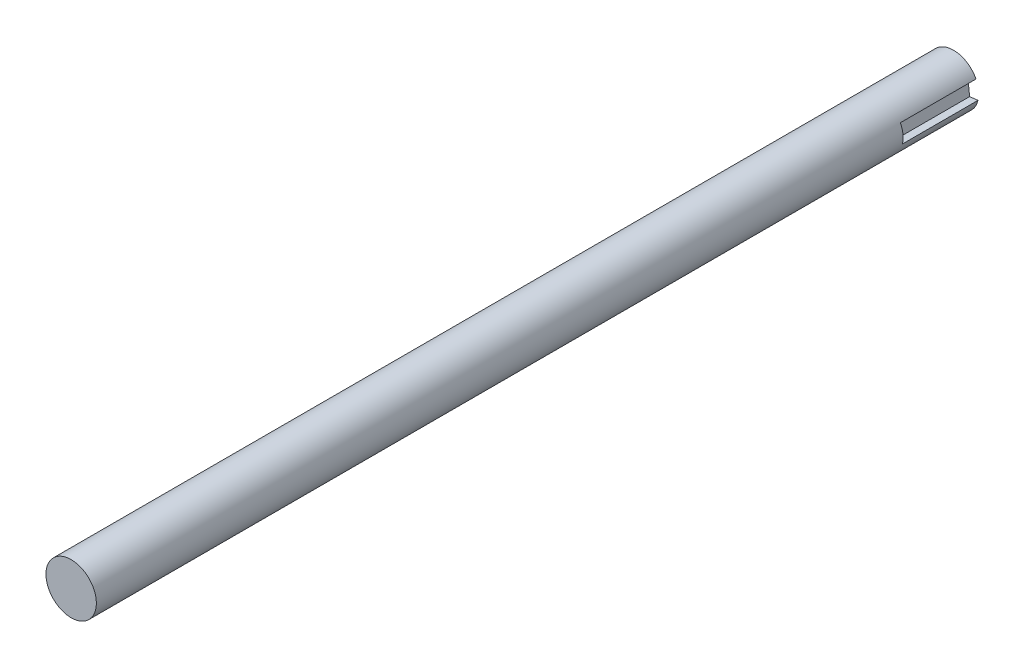
ISO-10303-21;
HEADER;
FILE_DESCRIPTION(('STEP AP214'),'2;1');
FILE_NAME('part.step','',(''),(''),'','','');
FILE_SCHEMA(('AUTOMOTIVE_DESIGN { 1 0 10303 214 1 1 1 1 }'));
ENDSEC;
DATA;
#1=APPLICATION_CONTEXT('core data for automotive mechanical design processes');
#2=APPLICATION_PROTOCOL_DEFINITION('international standard','automotive_design',2000,#1);
#3=PRODUCT_CONTEXT('',#1,'mechanical');
#4=PRODUCT('Part','Part','',(#3));
#5=PRODUCT_RELATED_PRODUCT_CATEGORY('part','',(#4));
#6=PRODUCT_DEFINITION_FORMATION('','',#4);
#7=PRODUCT_DEFINITION_CONTEXT('part definition',#1,'design');
#8=PRODUCT_DEFINITION('design','',#6,#7);
#9=PRODUCT_DEFINITION_SHAPE('','',#8);
#10=(LENGTH_UNIT() NAMED_UNIT(*) SI_UNIT(.MILLI.,.METRE.));
#11=(NAMED_UNIT(*) PLANE_ANGLE_UNIT() SI_UNIT($,.RADIAN.));
#12=(NAMED_UNIT(*) SI_UNIT($,.STERADIAN.) SOLID_ANGLE_UNIT());
#13=UNCERTAINTY_MEASURE_WITH_UNIT(LENGTH_MEASURE(1.E-05),#10,'distance_accuracy_value','');
#14=(GEOMETRIC_REPRESENTATION_CONTEXT(3) GLOBAL_UNCERTAINTY_ASSIGNED_CONTEXT((#13)) GLOBAL_UNIT_ASSIGNED_CONTEXT((#10,
#11,#12)) REPRESENTATION_CONTEXT('',''));
#15=CARTESIAN_POINT('',(0.,0.,0.));
#16=DIRECTION('',(0.,0.,1.));
#17=DIRECTION('',(1.,0.,0.));
#18=AXIS2_PLACEMENT_3D('',#15,#16,#17);
#19=CARTESIAN_POINT('',(0.,0.,-103.));
#20=DIRECTION('',(0.,0.,1.));
#21=DIRECTION('',(1.,0.,0.));
#22=AXIS2_PLACEMENT_3D('',#19,#20,#21);
#23=CYLINDRICAL_SURFACE('',#22,5.);
#24=DIRECTION('',(0.,0.,-1.));
#25=VECTOR('',#24,1.);
#26=CARTESIAN_POINT('',(4.45806607070023,2.26398915838203,-88.));
#27=LINE('',#26,#25);
#28=CARTESIAN_POINT('',(4.45806607070023,2.26398915838203,-88.));
#29=VERTEX_POINT('',#28);
#30=CARTESIAN_POINT('',(4.45806607070023,2.26398915838203,-103.));
#31=VERTEX_POINT('',#30);
#32=EDGE_CURVE('E58',#29,#31,#27,.T.);
#33=ORIENTED_EDGE('',*,*,#32,.T.);
#34=CARTESIAN_POINT('',(0.,0.,-103.));
#35=DIRECTION('',(0.,0.,1.));
#36=DIRECTION('',(1.,0.,0.));
#37=AXIS2_PLACEMENT_3D('',#34,#35,#36);
#38=CIRCLE('',#37,5.);
#39=CARTESIAN_POINT('',(4.85556715235497,-1.193091626394,-103.));
#40=VERTEX_POINT('',#39);
#41=EDGE_CURVE('E11',#31,#40,#38,.T.);
#42=ORIENTED_EDGE('',*,*,#41,.T.);
#43=DIRECTION('',(0.,0.,-1.));
#44=VECTOR('',#43,1.);
#45=CARTESIAN_POINT('',(4.85556715235497,-1.193091626394,-88.));
#46=LINE('',#45,#44);
#47=CARTESIAN_POINT('',(4.85556715235497,-1.193091626394,-88.));
#48=VERTEX_POINT('',#47);
#49=EDGE_CURVE('E49',#48,#40,#46,.T.);
#50=ORIENTED_EDGE('',*,*,#49,.F.);
#51=CARTESIAN_POINT('',(0.,0.,-88.));
#52=DIRECTION('',(0.,0.,-1.));
#53=DIRECTION('',(1.,0.,0.));
#54=AXIS2_PLACEMENT_3D('',#51,#52,#53);
#55=CIRCLE('',#54,5.00000000000008);
#56=EDGE_CURVE('E96',#29,#48,#55,.T.);
#57=ORIENTED_EDGE('',*,*,#56,.F.);
#58=EDGE_LOOP('',(#33,#42,#50,#57));
#59=FACE_BOUND('',#58,.T.);
#60=CARTESIAN_POINT('',(0.,0.,72.));
#61=DIRECTION('',(0.,0.,1.));
#62=DIRECTION('',(1.,0.,0.));
#63=AXIS2_PLACEMENT_3D('',#60,#61,#62);
#64=CIRCLE('',#63,5.);
#65=CARTESIAN_POINT('',(5.,0.,72.));
#66=VERTEX_POINT('',#65);
#67=EDGE_CURVE('E42',#66,#66,#64,.T.);
#68=ORIENTED_EDGE('',*,*,#67,.F.);
#69=EDGE_LOOP('',(#68));
#70=FACE_BOUND('',#69,.T.);
#71=ADVANCED_FACE('F35',(#59,#70),#23,.T.);
#72=CARTESIAN_POINT('',(0.,0.,-103.));
#73=DIRECTION('',(0.,0.,1.));
#74=DIRECTION('',(1.,0.,0.));
#75=AXIS2_PLACEMENT_3D('',#72,#73,#74);
#76=PLANE('',#75);
#77=ORIENTED_EDGE('',*,*,#41,.F.);
#78=DIRECTION('',(0.99458709907149,0.103906219065837,0.));
#79=VECTOR('',#78,1.);
#80=CARTESIAN_POINT('',(4.45806607070023,2.26398915838203,-103.));
#81=LINE('',#80,#79);
#82=CARTESIAN_POINT('',(2.80221363536456,2.09099941615904,-103.));
#83=VERTEX_POINT('',#82);
#84=EDGE_CURVE('E73',#83,#31,#81,.T.);
#85=ORIENTED_EDGE('',*,*,#84,.F.);
#86=DIRECTION('',(-0.112735179660313,0.993625069765733,0.));
#87=VECTOR('',#86,1.);
#88=CARTESIAN_POINT('',(3.1961825452027,-1.38136286421309,-103.));
#89=LINE('',#88,#87);
#90=CARTESIAN_POINT('',(3.1961825452027,-1.38136286421309,-103.));
#91=VERTEX_POINT('',#90);
#92=EDGE_CURVE('E102',#91,#83,#89,.T.);
#93=ORIENTED_EDGE('',*,*,#92,.F.);
#94=DIRECTION('',(-0.993625069765733,-0.112735179660313,0.));
#95=VECTOR('',#94,1.);
#96=CARTESIAN_POINT('',(4.85556715235497,-1.193091626394,-103.));
#97=LINE('',#96,#95);
#98=EDGE_CURVE('E82',#40,#91,#97,.T.);
#99=ORIENTED_EDGE('',*,*,#98,.F.);
#100=EDGE_LOOP('',(#77,#85,#93,#99));
#101=FACE_BOUND('',#100,.T.);
#102=ADVANCED_FACE('F113',(#101),#76,.F.);
#103=CARTESIAN_POINT('',(0.,0.,72.));
#104=DIRECTION('',(0.,0.,1.));
#105=DIRECTION('',(1.,0.,0.));
#106=AXIS2_PLACEMENT_3D('',#103,#104,#105);
#107=PLANE('',#106);
#108=ORIENTED_EDGE('',*,*,#67,.T.);
#109=EDGE_LOOP('',(#108));
#110=FACE_BOUND('',#109,.T.);
#111=ADVANCED_FACE('F110',(#110),#107,.T.);
#112=CARTESIAN_POINT('',(4.45806607070023,2.26398915838203,-88.));
#113=DIRECTION('',(-0.103906219065837,0.99458709907149,0.));
#114=DIRECTION('',(-0.99458709907149,-0.103906219065837,0.));
#115=AXIS2_PLACEMENT_3D('',#112,#113,#114);
#116=PLANE('',#115);
#117=ORIENTED_EDGE('',*,*,#84,.T.);
#118=ORIENTED_EDGE('',*,*,#32,.F.);
#119=DIRECTION('',(0.99458709907149,0.103906219065837,0.));
#120=VECTOR('',#119,1.);
#121=CARTESIAN_POINT('',(4.45806607070023,2.26398915838203,-88.));
#122=LINE('',#121,#120);
#123=CARTESIAN_POINT('',(2.80221363536456,2.09099941615904,-88.));
#124=VERTEX_POINT('',#123);
#125=EDGE_CURVE('E92',#124,#29,#122,.T.);
#126=ORIENTED_EDGE('',*,*,#125,.F.);
#127=DIRECTION('',(0.,0.,-1.));
#128=VECTOR('',#127,1.);
#129=CARTESIAN_POINT('',(2.80221363536456,2.09099941615904,-88.));
#130=LINE('',#129,#128);
#131=EDGE_CURVE('E86',#124,#83,#130,.T.);
#132=ORIENTED_EDGE('',*,*,#131,.T.);
#133=EDGE_LOOP('',(#117,#118,#126,#132));
#134=FACE_BOUND('',#133,.T.);
#135=ADVANCED_FACE('F123',(#134),#116,.F.);
#136=CARTESIAN_POINT('',(3.1961825452027,-1.38136286421309,-88.));
#137=DIRECTION('',(-0.993625069765733,-0.112735179660313,0.));
#138=DIRECTION('',(0.112735179660313,-0.993625069765733,0.));
#139=AXIS2_PLACEMENT_3D('',#136,#137,#138);
#140=PLANE('',#139);
#141=ORIENTED_EDGE('',*,*,#92,.T.);
#142=ORIENTED_EDGE('',*,*,#131,.F.);
#143=DIRECTION('',(-0.112735179660313,0.993625069765733,0.));
#144=VECTOR('',#143,1.);
#145=CARTESIAN_POINT('',(3.1961825452027,-1.38136286421309,-88.));
#146=LINE('',#145,#144);
#147=CARTESIAN_POINT('',(3.1961825452027,-1.38136286421309,-88.));
#148=VERTEX_POINT('',#147);
#149=EDGE_CURVE('E89',#148,#124,#146,.T.);
#150=ORIENTED_EDGE('',*,*,#149,.F.);
#151=DIRECTION('',(0.,0.,-1.));
#152=VECTOR('',#151,1.);
#153=CARTESIAN_POINT('',(3.1961825452027,-1.38136286421309,-88.));
#154=LINE('',#153,#152);
#155=EDGE_CURVE('E79',#148,#91,#154,.T.);
#156=ORIENTED_EDGE('',*,*,#155,.T.);
#157=EDGE_LOOP('',(#141,#142,#150,#156));
#158=FACE_BOUND('',#157,.T.);
#159=ADVANCED_FACE('F90',(#158),#140,.F.);
#160=CARTESIAN_POINT('',(4.85556715235497,-1.193091626394,-88.));
#161=DIRECTION('',(0.112735179660313,-0.993625069765733,0.));
#162=DIRECTION('',(0.993625069765733,0.112735179660313,0.));
#163=AXIS2_PLACEMENT_3D('',#160,#161,#162);
#164=PLANE('',#163);
#165=ORIENTED_EDGE('',*,*,#98,.T.);
#166=ORIENTED_EDGE('',*,*,#155,.F.);
#167=DIRECTION('',(-0.993625069765733,-0.112735179660313,0.));
#168=VECTOR('',#167,1.);
#169=CARTESIAN_POINT('',(4.85556715235497,-1.193091626394,-88.));
#170=LINE('',#169,#168);
#171=EDGE_CURVE('E77',#48,#148,#170,.T.);
#172=ORIENTED_EDGE('',*,*,#171,.F.);
#173=ORIENTED_EDGE('',*,*,#49,.T.);
#174=EDGE_LOOP('',(#165,#166,#172,#173));
#175=FACE_BOUND('',#174,.T.);
#176=ADVANCED_FACE('F81',(#175),#164,.F.);
#177=CARTESIAN_POINT('',(0.,0.,-88.));
#178=DIRECTION('',(0.,0.,1.));
#179=DIRECTION('',(1.,0.,0.));
#180=AXIS2_PLACEMENT_3D('',#177,#178,#179);
#181=PLANE('',#180);
#182=ORIENTED_EDGE('',*,*,#56,.T.);
#183=ORIENTED_EDGE('',*,*,#171,.T.);
#184=ORIENTED_EDGE('',*,*,#149,.T.);
#185=ORIENTED_EDGE('',*,*,#125,.T.);
#186=EDGE_LOOP('',(#182,#183,#184,#185));
#187=FACE_BOUND('',#186,.T.);
#188=ADVANCED_FACE('F94',(#187),#181,.F.);
#189=CLOSED_SHELL('',(#71,#102,#111,#135,#159,#176,#188));
#190=MANIFOLD_SOLID_BREP('B2',#189);
#191=ADVANCED_BREP_SHAPE_REPRESENTATION('',(#18,#190),#14);
#192=SHAPE_DEFINITION_REPRESENTATION(#9,#191);
ENDSEC;
END-ISO-10303-21;
